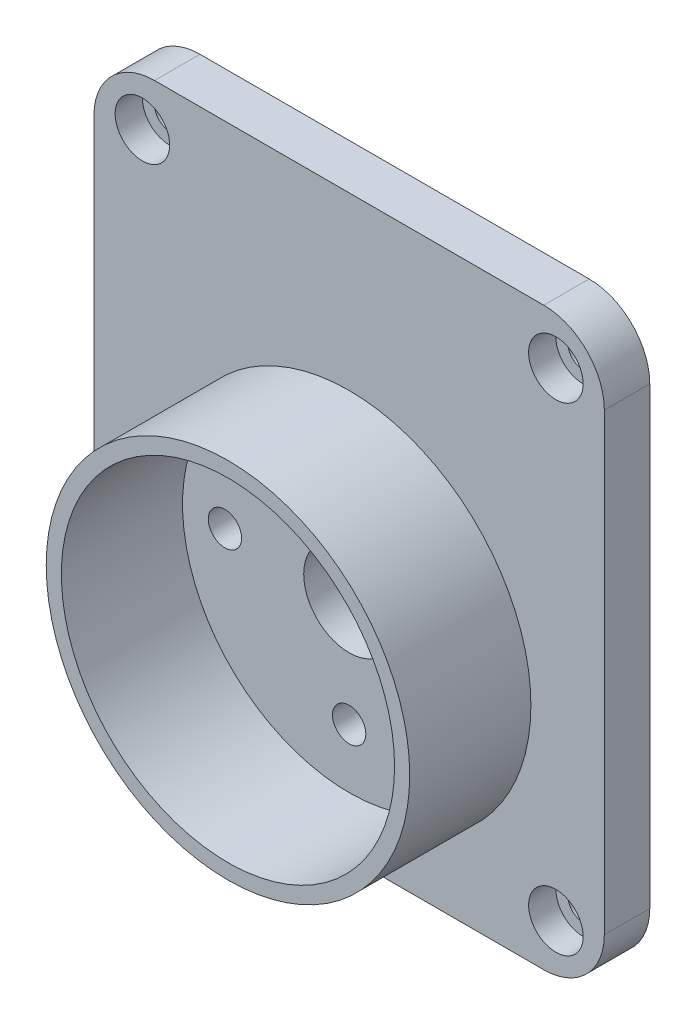
ISO-10303-21;
HEADER;
FILE_DESCRIPTION(('STEP AP214'),'2;1');
FILE_NAME('part.step','',(''),(''),'','','');
FILE_SCHEMA(('AUTOMOTIVE_DESIGN { 1 0 10303 214 1 1 1 1 }'));
ENDSEC;
DATA;
#1=APPLICATION_CONTEXT('core data for automotive mechanical design processes');
#2=APPLICATION_PROTOCOL_DEFINITION('international standard','automotive_design',2000,#1);
#3=PRODUCT_CONTEXT('',#1,'mechanical');
#4=PRODUCT('Part','Part','',(#3));
#5=PRODUCT_RELATED_PRODUCT_CATEGORY('part','',(#4));
#6=PRODUCT_DEFINITION_FORMATION('','',#4);
#7=PRODUCT_DEFINITION_CONTEXT('part definition',#1,'design');
#8=PRODUCT_DEFINITION('design','',#6,#7);
#9=PRODUCT_DEFINITION_SHAPE('','',#8);
#10=(LENGTH_UNIT() NAMED_UNIT(*) SI_UNIT(.MILLI.,.METRE.));
#11=(NAMED_UNIT(*) PLANE_ANGLE_UNIT() SI_UNIT($,.RADIAN.));
#12=(NAMED_UNIT(*) SI_UNIT($,.STERADIAN.) SOLID_ANGLE_UNIT());
#13=UNCERTAINTY_MEASURE_WITH_UNIT(LENGTH_MEASURE(1.E-05),#10,'distance_accuracy_value','');
#14=(GEOMETRIC_REPRESENTATION_CONTEXT(3) GLOBAL_UNCERTAINTY_ASSIGNED_CONTEXT((#13)) GLOBAL_UNIT_ASSIGNED_CONTEXT((#10,
#11,#12)) REPRESENTATION_CONTEXT('',''));
#15=CARTESIAN_POINT('',(0.,0.,0.));
#16=DIRECTION('',(0.,0.,1.));
#17=DIRECTION('',(1.,0.,0.));
#18=AXIS2_PLACEMENT_3D('',#15,#16,#17);
#19=CARTESIAN_POINT('',(-13.65,-11.5,3.));
#20=DIRECTION('',(0.,0.,-1.));
#21=DIRECTION('',(-1.,0.,0.));
#22=AXIS2_PLACEMENT_3D('',#19,#20,#21);
#23=CYLINDRICAL_SURFACE('',#22,1.);
#24=CARTESIAN_POINT('',(-13.65,-11.5,0.));
#25=DIRECTION('',(0.,0.,1.));
#26=DIRECTION('',(1.,0.,0.));
#27=AXIS2_PLACEMENT_3D('',#24,#25,#26);
#28=CIRCLE('',#27,1.);
#29=CARTESIAN_POINT('',(-12.65,-11.5,0.));
#30=VERTEX_POINT('',#29);
#31=EDGE_CURVE('E249',#30,#30,#28,.T.);
#32=ORIENTED_EDGE('',*,*,#31,.F.);
#33=EDGE_LOOP('',(#32));
#34=FACE_BOUND('',#33,.T.);
#35=CARTESIAN_POINT('',(-13.65,-11.5,1.2));
#36=DIRECTION('',(0.,0.,1.));
#37=DIRECTION('',(1.,0.,0.));
#38=AXIS2_PLACEMENT_3D('',#35,#36,#37);
#39=CIRCLE('',#38,1.);
#40=CARTESIAN_POINT('',(-12.65,-11.5,1.2));
#41=VERTEX_POINT('',#40);
#42=EDGE_CURVE('E315',#41,#41,#39,.T.);
#43=ORIENTED_EDGE('',*,*,#42,.T.);
#44=EDGE_LOOP('',(#43));
#45=FACE_BOUND('',#44,.T.);
#46=ADVANCED_FACE('F36',(#34,#45),#23,.F.);
#47=CARTESIAN_POINT('',(13.65,-11.5,3.));
#48=DIRECTION('',(0.,0.,-1.));
#49=DIRECTION('',(-1.,0.,0.));
#50=AXIS2_PLACEMENT_3D('',#47,#48,#49);
#51=CYLINDRICAL_SURFACE('',#50,0.999999999999999);
#52=CARTESIAN_POINT('',(13.65,-11.5,0.));
#53=DIRECTION('',(0.,0.,1.));
#54=DIRECTION('',(1.,0.,0.));
#55=AXIS2_PLACEMENT_3D('',#52,#53,#54);
#56=CIRCLE('',#55,0.999999999999999);
#57=CARTESIAN_POINT('',(14.65,-11.5,0.));
#58=VERTEX_POINT('',#57);
#59=EDGE_CURVE('E254',#58,#58,#56,.T.);
#60=ORIENTED_EDGE('',*,*,#59,.F.);
#61=EDGE_LOOP('',(#60));
#62=FACE_BOUND('',#61,.T.);
#63=CARTESIAN_POINT('',(13.65,-11.5,1.2));
#64=DIRECTION('',(0.,0.,1.));
#65=DIRECTION('',(1.,0.,0.));
#66=AXIS2_PLACEMENT_3D('',#63,#64,#65);
#67=CIRCLE('',#66,0.999999999999999);
#68=CARTESIAN_POINT('',(14.65,-11.5,1.2));
#69=VERTEX_POINT('',#68);
#70=EDGE_CURVE('E310',#69,#69,#67,.T.);
#71=ORIENTED_EDGE('',*,*,#70,.T.);
#72=EDGE_LOOP('',(#71));
#73=FACE_BOUND('',#72,.T.);
#74=ADVANCED_FACE('F392',(#62,#73),#51,.F.);
#75=CARTESIAN_POINT('',(13.65,20.1,3.));
#76=DIRECTION('',(0.,0.,-1.));
#77=DIRECTION('',(-1.,0.,0.));
#78=AXIS2_PLACEMENT_3D('',#75,#76,#77);
#79=CYLINDRICAL_SURFACE('',#78,1.);
#80=CARTESIAN_POINT('',(13.65,20.1,0.));
#81=DIRECTION('',(0.,0.,1.));
#82=DIRECTION('',(1.,0.,0.));
#83=AXIS2_PLACEMENT_3D('',#80,#81,#82);
#84=CIRCLE('',#83,1.);
#85=CARTESIAN_POINT('',(14.65,20.1,0.));
#86=VERTEX_POINT('',#85);
#87=EDGE_CURVE('E257',#86,#86,#84,.T.);
#88=ORIENTED_EDGE('',*,*,#87,.F.);
#89=EDGE_LOOP('',(#88));
#90=FACE_BOUND('',#89,.T.);
#91=CARTESIAN_POINT('',(13.65,20.1,1.2));
#92=DIRECTION('',(0.,0.,1.));
#93=DIRECTION('',(1.,0.,0.));
#94=AXIS2_PLACEMENT_3D('',#91,#92,#93);
#95=CIRCLE('',#94,1.);
#96=CARTESIAN_POINT('',(14.65,20.1,1.2));
#97=VERTEX_POINT('',#96);
#98=EDGE_CURVE('E306',#97,#97,#95,.T.);
#99=ORIENTED_EDGE('',*,*,#98,.T.);
#100=EDGE_LOOP('',(#99));
#101=FACE_BOUND('',#100,.T.);
#102=ADVANCED_FACE('F398',(#90,#101),#79,.F.);
#103=CARTESIAN_POINT('',(-13.65,20.1,3.));
#104=DIRECTION('',(0.,0.,-1.));
#105=DIRECTION('',(-1.,0.,0.));
#106=AXIS2_PLACEMENT_3D('',#103,#104,#105);
#107=CYLINDRICAL_SURFACE('',#106,1.);
#108=CARTESIAN_POINT('',(-13.65,20.1,0.));
#109=DIRECTION('',(0.,0.,1.));
#110=DIRECTION('',(1.,0.,0.));
#111=AXIS2_PLACEMENT_3D('',#108,#109,#110);
#112=CIRCLE('',#111,1.);
#113=CARTESIAN_POINT('',(-12.65,20.1,0.));
#114=VERTEX_POINT('',#113);
#115=EDGE_CURVE('E260',#114,#114,#112,.T.);
#116=ORIENTED_EDGE('',*,*,#115,.F.);
#117=EDGE_LOOP('',(#116));
#118=FACE_BOUND('',#117,.T.);
#119=CARTESIAN_POINT('',(-13.65,20.1,1.2));
#120=DIRECTION('',(0.,0.,1.));
#121=DIRECTION('',(1.,0.,0.));
#122=AXIS2_PLACEMENT_3D('',#119,#120,#121);
#123=CIRCLE('',#122,1.);
#124=CARTESIAN_POINT('',(-12.65,20.1,1.2));
#125=VERTEX_POINT('',#124);
#126=EDGE_CURVE('E213',#125,#125,#123,.T.);
#127=ORIENTED_EDGE('',*,*,#126,.T.);
#128=EDGE_LOOP('',(#127));
#129=FACE_BOUND('',#128,.T.);
#130=ADVANCED_FACE('F409',(#118,#129),#107,.F.);
#131=CARTESIAN_POINT('',(0.,0.,0.));
#132=DIRECTION('',(0.,0.,1.));
#133=DIRECTION('',(1.,0.,0.));
#134=AXIS2_PLACEMENT_3D('',#131,#132,#133);
#135=PLANE('',#134);
#136=ORIENTED_EDGE('',*,*,#31,.T.);
#137=EDGE_LOOP('',(#136));
#138=FACE_BOUND('',#137,.T.);
#139=ORIENTED_EDGE('',*,*,#59,.T.);
#140=EDGE_LOOP('',(#139));
#141=FACE_BOUND('',#140,.T.);
#142=ORIENTED_EDGE('',*,*,#87,.T.);
#143=EDGE_LOOP('',(#142));
#144=FACE_BOUND('',#143,.T.);
#145=ORIENTED_EDGE('',*,*,#115,.T.);
#146=EDGE_LOOP('',(#145));
#147=FACE_BOUND('',#146,.T.);
#148=DIRECTION('',(0.,-1.,0.));
#149=VECTOR('',#148,1.);
#150=CARTESIAN_POINT('',(-16.85,0.,0.));
#151=LINE('',#150,#149);
#152=CARTESIAN_POINT('',(-16.85,19.3,0.));
#153=VERTEX_POINT('',#152);
#154=CARTESIAN_POINT('',(-16.85,-10.7,0.));
#155=VERTEX_POINT('',#154);
#156=EDGE_CURVE('E278',#153,#155,#151,.T.);
#157=ORIENTED_EDGE('',*,*,#156,.F.);
#158=CARTESIAN_POINT('',(-12.85,19.3,0.));
#159=DIRECTION('',(0.,0.,1.));
#160=DIRECTION('',(1.,0.,0.));
#161=AXIS2_PLACEMENT_3D('',#158,#159,#160);
#162=CIRCLE('',#161,4.);
#163=CARTESIAN_POINT('',(-12.85,23.3,0.));
#164=VERTEX_POINT('',#163);
#165=EDGE_CURVE('E330',#153,#164,#162,.F.);
#166=ORIENTED_EDGE('',*,*,#165,.T.);
#167=DIRECTION('',(-1.,0.,0.));
#168=VECTOR('',#167,1.);
#169=CARTESIAN_POINT('',(16.85,23.3,0.));
#170=LINE('',#169,#168);
#171=CARTESIAN_POINT('',(12.85,23.3,0.));
#172=VERTEX_POINT('',#171);
#173=EDGE_CURVE('E283',#172,#164,#170,.T.);
#174=ORIENTED_EDGE('',*,*,#173,.F.);
#175=CARTESIAN_POINT('',(12.85,19.3,0.));
#176=DIRECTION('',(0.,0.,1.));
#177=DIRECTION('',(1.,0.,0.));
#178=AXIS2_PLACEMENT_3D('',#175,#176,#177);
#179=CIRCLE('',#178,4.);
#180=CARTESIAN_POINT('',(16.85,19.3,0.));
#181=VERTEX_POINT('',#180);
#182=EDGE_CURVE('E324',#172,#181,#179,.F.);
#183=ORIENTED_EDGE('',*,*,#182,.T.);
#184=DIRECTION('',(0.,1.,0.));
#185=VECTOR('',#184,1.);
#186=CARTESIAN_POINT('',(16.85,-14.7,0.));
#187=LINE('',#186,#185);
#188=CARTESIAN_POINT('',(16.85,-10.7,0.));
#189=VERTEX_POINT('',#188);
#190=EDGE_CURVE('E296',#189,#181,#187,.T.);
#191=ORIENTED_EDGE('',*,*,#190,.F.);
#192=CARTESIAN_POINT('',(12.85,-10.7,0.));
#193=DIRECTION('',(0.,0.,1.));
#194=DIRECTION('',(1.,0.,0.));
#195=AXIS2_PLACEMENT_3D('',#192,#193,#194);
#196=CIRCLE('',#195,4.);
#197=CARTESIAN_POINT('',(12.85,-14.7,0.));
#198=VERTEX_POINT('',#197);
#199=EDGE_CURVE('E326',#189,#198,#196,.F.);
#200=ORIENTED_EDGE('',*,*,#199,.T.);
#201=DIRECTION('',(1.,0.,0.));
#202=VECTOR('',#201,1.);
#203=CARTESIAN_POINT('',(0.,-14.7,0.));
#204=LINE('',#203,#202);
#205=CARTESIAN_POINT('',(-12.85,-14.7,0.));
#206=VERTEX_POINT('',#205);
#207=EDGE_CURVE('E293',#206,#198,#204,.T.);
#208=ORIENTED_EDGE('',*,*,#207,.F.);
#209=CARTESIAN_POINT('',(-12.85,-10.7,0.));
#210=DIRECTION('',(0.,0.,1.));
#211=DIRECTION('',(1.,0.,0.));
#212=AXIS2_PLACEMENT_3D('',#209,#210,#211);
#213=CIRCLE('',#212,4.);
#214=EDGE_CURVE('E328',#206,#155,#213,.F.);
#215=ORIENTED_EDGE('',*,*,#214,.T.);
#216=EDGE_LOOP('',(#157,#166,#174,#183,#191,#200,#208,#215));
#217=FACE_BOUND('',#216,.T.);
#218=CARTESIAN_POINT('',(-13.65,-11.5,0.));
#219=DIRECTION('',(0.,0.,-1.));
#220=DIRECTION('',(-1.,0.,0.));
#221=AXIS2_PLACEMENT_3D('',#218,#219,#220);
#222=CIRCLE('',#221,3.20000000000001);
#223=CARTESIAN_POINT('',(-15.85,-9.17620999227555,0.));
#224=VERTEX_POINT('',#223);
#225=CARTESIAN_POINT('',(-11.3262099922755,-13.7,0.));
#226=VERTEX_POINT('',#225);
#227=EDGE_CURVE('E168',#224,#226,#222,.T.);
#228=ORIENTED_EDGE('',*,*,#227,.T.);
#229=DIRECTION('',(-1.,0.,0.));
#230=VECTOR('',#229,1.);
#231=CARTESIAN_POINT('',(0.,-13.7,0.));
#232=LINE('',#231,#230);
#233=CARTESIAN_POINT('',(11.3262099922756,-13.7,0.));
#234=VERTEX_POINT('',#233);
#235=EDGE_CURVE('E177',#234,#226,#232,.T.);
#236=ORIENTED_EDGE('',*,*,#235,.F.);
#237=CARTESIAN_POINT('',(13.65,-11.5,0.));
#238=DIRECTION('',(0.,0.,-1.));
#239=DIRECTION('',(-1.,0.,0.));
#240=AXIS2_PLACEMENT_3D('',#237,#238,#239);
#241=CIRCLE('',#240,3.19999999999999);
#242=CARTESIAN_POINT('',(15.85,-9.17620999227554,0.));
#243=VERTEX_POINT('',#242);
#244=EDGE_CURVE('E180',#234,#243,#241,.T.);
#245=ORIENTED_EDGE('',*,*,#244,.T.);
#246=DIRECTION('',(0.,-1.,0.));
#247=VECTOR('',#246,1.);
#248=CARTESIAN_POINT('',(15.85,0.,0.));
#249=LINE('',#248,#247);
#250=CARTESIAN_POINT('',(15.85,17.7762099922755,0.));
#251=VERTEX_POINT('',#250);
#252=EDGE_CURVE('E224',#251,#243,#249,.T.);
#253=ORIENTED_EDGE('',*,*,#252,.F.);
#254=CARTESIAN_POINT('',(13.65,20.1,0.));
#255=DIRECTION('',(0.,0.,-1.));
#256=DIRECTION('',(-1.,0.,0.));
#257=AXIS2_PLACEMENT_3D('',#254,#255,#256);
#258=CIRCLE('',#257,3.2);
#259=CARTESIAN_POINT('',(11.3262099922756,22.3,0.));
#260=VERTEX_POINT('',#259);
#261=EDGE_CURVE('E221',#251,#260,#258,.T.);
#262=ORIENTED_EDGE('',*,*,#261,.T.);
#263=DIRECTION('',(-1.,0.,0.));
#264=VECTOR('',#263,1.);
#265=CARTESIAN_POINT('',(0.,22.3,0.));
#266=LINE('',#265,#264);
#267=CARTESIAN_POINT('',(-11.3262099922755,22.3,0.));
#268=VERTEX_POINT('',#267);
#269=EDGE_CURVE('E218',#260,#268,#266,.T.);
#270=ORIENTED_EDGE('',*,*,#269,.T.);
#271=CARTESIAN_POINT('',(-13.65,20.1,0.));
#272=DIRECTION('',(0.,0.,-1.));
#273=DIRECTION('',(-1.,0.,0.));
#274=AXIS2_PLACEMENT_3D('',#271,#272,#273);
#275=CIRCLE('',#274,3.20000000000001);
#276=CARTESIAN_POINT('',(-15.85,17.7762099922755,0.));
#277=VERTEX_POINT('',#276);
#278=EDGE_CURVE('E215',#268,#277,#275,.T.);
#279=ORIENTED_EDGE('',*,*,#278,.T.);
#280=DIRECTION('',(0.,-1.,0.));
#281=VECTOR('',#280,1.);
#282=CARTESIAN_POINT('',(-15.85,0.,0.));
#283=LINE('',#282,#281);
#284=EDGE_CURVE('E212',#277,#224,#283,.T.);
#285=ORIENTED_EDGE('',*,*,#284,.T.);
#286=EDGE_LOOP('',(#228,#236,#245,#253,#262,#270,#279,#285));
#287=FACE_BOUND('',#286,.T.);
#288=ADVANCED_FACE('F358',(#138,#141,#144,#147,#217,#287),#135,.F.);
#289=CARTESIAN_POINT('',(0.,0.,3.));
#290=DIRECTION('',(0.,0.,-1.));
#291=DIRECTION('',(-1.,0.,0.));
#292=AXIS2_PLACEMENT_3D('',#289,#290,#291);
#293=CYLINDRICAL_SURFACE('',#292,3.);
#294=CARTESIAN_POINT('',(0.,0.,3.));
#295=DIRECTION('',(0.,0.,1.));
#296=DIRECTION('',(1.,0.,0.));
#297=AXIS2_PLACEMENT_3D('',#294,#295,#296);
#298=CIRCLE('',#297,3.);
#299=CARTESIAN_POINT('',(3.,0.,3.));
#300=VERTEX_POINT('',#299);
#301=EDGE_CURVE('E275',#300,#300,#298,.T.);
#302=ORIENTED_EDGE('',*,*,#301,.T.);
#303=EDGE_LOOP('',(#302));
#304=FACE_BOUND('',#303,.T.);
#305=CARTESIAN_POINT('',(0.,0.,1.));
#306=DIRECTION('',(0.,0.,-1.));
#307=DIRECTION('',(-1.,0.,0.));
#308=AXIS2_PLACEMENT_3D('',#305,#306,#307);
#309=CIRCLE('',#308,3.);
#310=CARTESIAN_POINT('',(-3.,0.,1.));
#311=VERTEX_POINT('',#310);
#312=EDGE_CURVE('E197',#311,#311,#309,.F.);
#313=ORIENTED_EDGE('',*,*,#312,.F.);
#314=EDGE_LOOP('',(#313));
#315=FACE_BOUND('',#314,.T.);
#316=ADVANCED_FACE('F430',(#304,#315),#293,.F.);
#317=CARTESIAN_POINT('',(-8.2,0.,3.));
#318=DIRECTION('',(0.,0.,-1.));
#319=DIRECTION('',(-1.,0.,0.));
#320=AXIS2_PLACEMENT_3D('',#317,#318,#319);
#321=CYLINDRICAL_SURFACE('',#320,1.1);
#322=CARTESIAN_POINT('',(-8.2,0.,3.));
#323=DIRECTION('',(0.,0.,1.));
#324=DIRECTION('',(1.,0.,0.));
#325=AXIS2_PLACEMENT_3D('',#322,#323,#324);
#326=CIRCLE('',#325,1.1);
#327=CARTESIAN_POINT('',(-7.1,0.,3.));
#328=VERTEX_POINT('',#327);
#329=EDGE_CURVE('E272',#328,#328,#326,.T.);
#330=ORIENTED_EDGE('',*,*,#329,.T.);
#331=EDGE_LOOP('',(#330));
#332=FACE_BOUND('',#331,.T.);
#333=CARTESIAN_POINT('',(-8.2,0.,1.));
#334=DIRECTION('',(0.,0.,-1.));
#335=DIRECTION('',(-1.,0.,0.));
#336=AXIS2_PLACEMENT_3D('',#333,#334,#335);
#337=CIRCLE('',#336,1.1);
#338=CARTESIAN_POINT('',(-9.3,0.,1.));
#339=VERTEX_POINT('',#338);
#340=EDGE_CURVE('E169',#339,#339,#337,.F.);
#341=ORIENTED_EDGE('',*,*,#340,.F.);
#342=EDGE_LOOP('',(#341));
#343=FACE_BOUND('',#342,.T.);
#344=ADVANCED_FACE('F426',(#332,#343),#321,.F.);
#345=CARTESIAN_POINT('',(8.2,0.,3.));
#346=DIRECTION('',(0.,0.,-1.));
#347=DIRECTION('',(-1.,0.,0.));
#348=AXIS2_PLACEMENT_3D('',#345,#346,#347);
#349=CYLINDRICAL_SURFACE('',#348,1.1);
#350=CARTESIAN_POINT('',(8.2,0.,3.));
#351=DIRECTION('',(0.,0.,1.));
#352=DIRECTION('',(1.,0.,0.));
#353=AXIS2_PLACEMENT_3D('',#350,#351,#352);
#354=CIRCLE('',#353,1.1);
#355=CARTESIAN_POINT('',(9.3,0.,3.));
#356=VERTEX_POINT('',#355);
#357=EDGE_CURVE('E269',#356,#356,#354,.T.);
#358=ORIENTED_EDGE('',*,*,#357,.T.);
#359=EDGE_LOOP('',(#358));
#360=FACE_BOUND('',#359,.T.);
#361=CARTESIAN_POINT('',(8.2,0.,1.));
#362=DIRECTION('',(0.,0.,-1.));
#363=DIRECTION('',(-1.,0.,0.));
#364=AXIS2_PLACEMENT_3D('',#361,#362,#363);
#365=CIRCLE('',#364,1.1);
#366=CARTESIAN_POINT('',(7.1,0.,1.));
#367=VERTEX_POINT('',#366);
#368=EDGE_CURVE('E200',#367,#367,#365,.F.);
#369=ORIENTED_EDGE('',*,*,#368,.F.);
#370=EDGE_LOOP('',(#369));
#371=FACE_BOUND('',#370,.T.);
#372=ADVANCED_FACE('F422',(#360,#371),#349,.F.);
#373=CARTESIAN_POINT('',(0.,7.1,3.));
#374=DIRECTION('',(0.,0.,-1.));
#375=DIRECTION('',(-1.,0.,0.));
#376=AXIS2_PLACEMENT_3D('',#373,#374,#375);
#377=CYLINDRICAL_SURFACE('',#376,1.1);
#378=CARTESIAN_POINT('',(0.,7.1,3.));
#379=DIRECTION('',(0.,0.,1.));
#380=DIRECTION('',(1.,0.,0.));
#381=AXIS2_PLACEMENT_3D('',#378,#379,#380);
#382=CIRCLE('',#381,1.1);
#383=CARTESIAN_POINT('',(1.1,7.1,3.));
#384=VERTEX_POINT('',#383);
#385=EDGE_CURVE('E266',#384,#384,#382,.T.);
#386=ORIENTED_EDGE('',*,*,#385,.T.);
#387=EDGE_LOOP('',(#386));
#388=FACE_BOUND('',#387,.T.);
#389=CARTESIAN_POINT('',(0.,7.1,1.));
#390=DIRECTION('',(0.,0.,-1.));
#391=DIRECTION('',(-1.,0.,0.));
#392=AXIS2_PLACEMENT_3D('',#389,#390,#391);
#393=CIRCLE('',#392,1.1);
#394=CARTESIAN_POINT('',(-1.1,7.1,1.));
#395=VERTEX_POINT('',#394);
#396=EDGE_CURVE('E206',#395,#395,#393,.F.);
#397=ORIENTED_EDGE('',*,*,#396,.F.);
#398=EDGE_LOOP('',(#397));
#399=FACE_BOUND('',#398,.T.);
#400=ADVANCED_FACE('F418',(#388,#399),#377,.F.);
#401=CARTESIAN_POINT('',(0.,-7.1,3.));
#402=DIRECTION('',(0.,0.,-1.));
#403=DIRECTION('',(-1.,0.,0.));
#404=AXIS2_PLACEMENT_3D('',#401,#402,#403);
#405=CYLINDRICAL_SURFACE('',#404,1.1);
#406=CARTESIAN_POINT('',(0.,-7.1,3.));
#407=DIRECTION('',(0.,0.,1.));
#408=DIRECTION('',(1.,0.,0.));
#409=AXIS2_PLACEMENT_3D('',#406,#407,#408);
#410=CIRCLE('',#409,1.1);
#411=CARTESIAN_POINT('',(1.1,-7.1,3.));
#412=VERTEX_POINT('',#411);
#413=EDGE_CURVE('E263',#412,#412,#410,.T.);
#414=ORIENTED_EDGE('',*,*,#413,.T.);
#415=EDGE_LOOP('',(#414));
#416=FACE_BOUND('',#415,.T.);
#417=CARTESIAN_POINT('',(0.,-7.1,1.));
#418=DIRECTION('',(0.,0.,-1.));
#419=DIRECTION('',(-1.,0.,0.));
#420=AXIS2_PLACEMENT_3D('',#417,#418,#419);
#421=CIRCLE('',#420,1.1);
#422=CARTESIAN_POINT('',(-1.1,-7.1,1.));
#423=VERTEX_POINT('',#422);
#424=EDGE_CURVE('E203',#423,#423,#421,.F.);
#425=ORIENTED_EDGE('',*,*,#424,.F.);
#426=EDGE_LOOP('',(#425));
#427=FACE_BOUND('',#426,.T.);
#428=ADVANCED_FACE('F414',(#416,#427),#405,.F.);
#429=CARTESIAN_POINT('',(0.,0.,3.));
#430=DIRECTION('',(0.,0.,1.));
#431=DIRECTION('',(1.,0.,0.));
#432=AXIS2_PLACEMENT_3D('',#429,#430,#431);
#433=PLANE('',#432);
#434=ORIENTED_EDGE('',*,*,#413,.F.);
#435=EDGE_LOOP('',(#434));
#436=FACE_BOUND('',#435,.T.);
#437=ORIENTED_EDGE('',*,*,#357,.F.);
#438=EDGE_LOOP('',(#437));
#439=FACE_BOUND('',#438,.T.);
#440=ORIENTED_EDGE('',*,*,#301,.F.);
#441=EDGE_LOOP('',(#440));
#442=FACE_BOUND('',#441,.T.);
#443=ORIENTED_EDGE('',*,*,#329,.F.);
#444=EDGE_LOOP('',(#443));
#445=FACE_BOUND('',#444,.T.);
#446=ORIENTED_EDGE('',*,*,#385,.F.);
#447=EDGE_LOOP('',(#446));
#448=FACE_BOUND('',#447,.T.);
#449=CARTESIAN_POINT('',(0.,0.,3.));
#450=DIRECTION('',(0.,0.,1.));
#451=DIRECTION('',(1.,0.,0.));
#452=AXIS2_PLACEMENT_3D('',#449,#450,#451);
#453=CIRCLE('',#452,11.);
#454=CARTESIAN_POINT('',(11.,0.,3.));
#455=VERTEX_POINT('',#454);
#456=EDGE_CURVE('E290',#455,#455,#453,.F.);
#457=ORIENTED_EDGE('',*,*,#456,.F.);
#458=EDGE_LOOP('',(#457));
#459=FACE_BOUND('',#458,.T.);
#460=ADVANCED_FACE('F417',(#436,#439,#442,#445,#448,#459),#433,.T.);
#461=CARTESIAN_POINT('',(-13.65,-11.5,3.));
#462=DIRECTION('',(0.,0.,1.));
#463=DIRECTION('',(1.,0.,0.));
#464=AXIS2_PLACEMENT_3D('',#461,#462,#463);
#465=CIRCLE('',#464,1.8);
#466=CARTESIAN_POINT('',(-11.85,-11.5,3.));
#467=VERTEX_POINT('',#466);
#468=EDGE_CURVE('E793',#467,#467,#465,.T.);
#469=ORIENTED_EDGE('',*,*,#468,.F.);
#470=EDGE_LOOP('',(#469));
#471=FACE_BOUND('',#470,.T.);
#472=CARTESIAN_POINT('',(13.65,-11.5,3.));
#473=DIRECTION('',(0.,0.,1.));
#474=DIRECTION('',(1.,0.,0.));
#475=AXIS2_PLACEMENT_3D('',#472,#473,#474);
#476=CIRCLE('',#475,1.8);
#477=CARTESIAN_POINT('',(15.45,-11.5,3.));
#478=VERTEX_POINT('',#477);
#479=EDGE_CURVE('E318',#478,#478,#476,.T.);
#480=ORIENTED_EDGE('',*,*,#479,.F.);
#481=EDGE_LOOP('',(#480));
#482=FACE_BOUND('',#481,.T.);
#483=CARTESIAN_POINT('',(13.65,20.1,3.));
#484=DIRECTION('',(0.,0.,1.));
#485=DIRECTION('',(1.,0.,0.));
#486=AXIS2_PLACEMENT_3D('',#483,#484,#485);
#487=CIRCLE('',#486,1.8);
#488=CARTESIAN_POINT('',(15.45,20.1,3.));
#489=VERTEX_POINT('',#488);
#490=EDGE_CURVE('E313',#489,#489,#487,.T.);
#491=ORIENTED_EDGE('',*,*,#490,.F.);
#492=EDGE_LOOP('',(#491));
#493=FACE_BOUND('',#492,.T.);
#494=CARTESIAN_POINT('',(-13.65,20.1,3.));
#495=DIRECTION('',(0.,0.,1.));
#496=DIRECTION('',(1.,0.,0.));
#497=AXIS2_PLACEMENT_3D('',#494,#495,#496);
#498=CIRCLE('',#497,1.8);
#499=CARTESIAN_POINT('',(-11.85,20.1,3.));
#500=VERTEX_POINT('',#499);
#501=EDGE_CURVE('E183',#500,#500,#498,.T.);
#502=ORIENTED_EDGE('',*,*,#501,.F.);
#503=EDGE_LOOP('',(#502));
#504=FACE_BOUND('',#503,.T.);
#505=CARTESIAN_POINT('',(0.,0.,3.));
#506=DIRECTION('',(0.,0.,1.));
#507=DIRECTION('',(1.,0.,0.));
#508=AXIS2_PLACEMENT_3D('',#505,#506,#507);
#509=CIRCLE('',#508,12.);
#510=CARTESIAN_POINT('',(12.,0.,3.));
#511=VERTEX_POINT('',#510);
#512=EDGE_CURVE('E245',#511,#511,#509,.T.);
#513=ORIENTED_EDGE('',*,*,#512,.F.);
#514=EDGE_LOOP('',(#513));
#515=FACE_BOUND('',#514,.T.);
#516=DIRECTION('',(-1.,0.,0.));
#517=VECTOR('',#516,1.);
#518=CARTESIAN_POINT('',(16.85,23.3,3.));
#519=LINE('',#518,#517);
#520=CARTESIAN_POINT('',(12.85,23.3,3.));
#521=VERTEX_POINT('',#520);
#522=CARTESIAN_POINT('',(-12.85,23.3,3.));
#523=VERTEX_POINT('',#522);
#524=EDGE_CURVE('E287',#521,#523,#519,.T.);
#525=ORIENTED_EDGE('',*,*,#524,.T.);
#526=CARTESIAN_POINT('',(-12.85,19.3,3.));
#527=DIRECTION('',(0.,0.,1.));
#528=DIRECTION('',(1.,0.,0.));
#529=AXIS2_PLACEMENT_3D('',#526,#527,#528);
#530=CIRCLE('',#529,4.);
#531=CARTESIAN_POINT('',(-16.85,19.3,3.));
#532=VERTEX_POINT('',#531);
#533=EDGE_CURVE('E342',#523,#532,#530,.T.);
#534=ORIENTED_EDGE('',*,*,#533,.T.);
#535=DIRECTION('',(0.,-1.,0.));
#536=VECTOR('',#535,1.);
#537=CARTESIAN_POINT('',(-16.85,23.3,3.));
#538=LINE('',#537,#536);
#539=CARTESIAN_POINT('',(-16.85,-10.7,3.));
#540=VERTEX_POINT('',#539);
#541=EDGE_CURVE('E279',#532,#540,#538,.T.);
#542=ORIENTED_EDGE('',*,*,#541,.T.);
#543=CARTESIAN_POINT('',(-12.85,-10.7,3.));
#544=DIRECTION('',(0.,0.,1.));
#545=DIRECTION('',(1.,0.,0.));
#546=AXIS2_PLACEMENT_3D('',#543,#544,#545);
#547=CIRCLE('',#546,4.);
#548=CARTESIAN_POINT('',(-12.85,-14.7,3.));
#549=VERTEX_POINT('',#548);
#550=EDGE_CURVE('E340',#540,#549,#547,.T.);
#551=ORIENTED_EDGE('',*,*,#550,.T.);
#552=DIRECTION('',(1.,0.,0.));
#553=VECTOR('',#552,1.);
#554=CARTESIAN_POINT('',(-16.85,-14.7,3.));
#555=LINE('',#554,#553);
#556=CARTESIAN_POINT('',(12.85,-14.7,3.));
#557=VERTEX_POINT('',#556);
#558=EDGE_CURVE('E282',#549,#557,#555,.T.);
#559=ORIENTED_EDGE('',*,*,#558,.T.);
#560=CARTESIAN_POINT('',(12.85,-10.7,3.));
#561=DIRECTION('',(0.,0.,1.));
#562=DIRECTION('',(1.,0.,0.));
#563=AXIS2_PLACEMENT_3D('',#560,#561,#562);
#564=CIRCLE('',#563,4.);
#565=CARTESIAN_POINT('',(16.85,-10.7,3.));
#566=VERTEX_POINT('',#565);
#567=EDGE_CURVE('E57',#557,#566,#564,.T.);
#568=ORIENTED_EDGE('',*,*,#567,.T.);
#569=DIRECTION('',(0.,1.,0.));
#570=VECTOR('',#569,1.);
#571=CARTESIAN_POINT('',(16.85,-14.7,3.));
#572=LINE('',#571,#570);
#573=CARTESIAN_POINT('',(16.85,19.3,3.));
#574=VERTEX_POINT('',#573);
#575=EDGE_CURVE('E285',#566,#574,#572,.T.);
#576=ORIENTED_EDGE('',*,*,#575,.T.);
#577=CARTESIAN_POINT('',(12.85,19.3,3.));
#578=DIRECTION('',(0.,0.,1.));
#579=DIRECTION('',(1.,0.,0.));
#580=AXIS2_PLACEMENT_3D('',#577,#578,#579);
#581=CIRCLE('',#580,4.);
#582=EDGE_CURVE('E337',#574,#521,#581,.T.);
#583=ORIENTED_EDGE('',*,*,#582,.T.);
#584=EDGE_LOOP('',(#525,#534,#542,#551,#559,#568,#576,#583));
#585=FACE_BOUND('',#584,.T.);
#586=ADVANCED_FACE('F366',(#471,#482,#493,#504,#515,#585),#433,.T.);
#587=CARTESIAN_POINT('',(-16.85,0.,3.));
#588=DIRECTION('',(1.,0.,0.));
#589=DIRECTION('',(0.,1.,0.));
#590=AXIS2_PLACEMENT_3D('',#587,#588,#589);
#591=PLANE('',#590);
#592=ORIENTED_EDGE('',*,*,#541,.F.);
#593=DIRECTION('',(0.,0.,-1.));
#594=VECTOR('',#593,1.);
#595=CARTESIAN_POINT('',(-16.85,19.3,3.));
#596=LINE('',#595,#594);
#597=EDGE_CURVE('E321',#532,#153,#596,.T.);
#598=ORIENTED_EDGE('',*,*,#597,.T.);
#599=ORIENTED_EDGE('',*,*,#156,.T.);
#600=DIRECTION('',(0.,0.,-1.));
#601=VECTOR('',#600,1.);
#602=CARTESIAN_POINT('',(-16.85,-10.7,3.));
#603=LINE('',#602,#601);
#604=EDGE_CURVE('E302',#155,#540,#603,.F.);
#605=ORIENTED_EDGE('',*,*,#604,.T.);
#606=EDGE_LOOP('',(#592,#598,#599,#605));
#607=FACE_BOUND('',#606,.T.);
#608=ADVANCED_FACE('F380',(#607),#591,.F.);
#609=CARTESIAN_POINT('',(0.,-14.7,3.));
#610=DIRECTION('',(0.,1.,0.));
#611=DIRECTION('',(-1.,0.,0.));
#612=AXIS2_PLACEMENT_3D('',#609,#610,#611);
#613=PLANE('',#612);
#614=ORIENTED_EDGE('',*,*,#558,.F.);
#615=DIRECTION('',(0.,0.,-1.));
#616=VECTOR('',#615,1.);
#617=CARTESIAN_POINT('',(-12.85,-14.7,3.));
#618=LINE('',#617,#616);
#619=EDGE_CURVE('E346',#549,#206,#618,.T.);
#620=ORIENTED_EDGE('',*,*,#619,.T.);
#621=ORIENTED_EDGE('',*,*,#207,.T.);
#622=DIRECTION('',(0.,0.,-1.));
#623=VECTOR('',#622,1.);
#624=CARTESIAN_POINT('',(12.85,-14.7,3.));
#625=LINE('',#624,#623);
#626=EDGE_CURVE('E344',#198,#557,#625,.F.);
#627=ORIENTED_EDGE('',*,*,#626,.T.);
#628=EDGE_LOOP('',(#614,#620,#621,#627));
#629=FACE_BOUND('',#628,.T.);
#630=ADVANCED_FACE('F352',(#629),#613,.F.);
#631=CARTESIAN_POINT('',(16.85,-14.7,3.));
#632=DIRECTION('',(-1.,0.,0.));
#633=DIRECTION('',(0.,-1.,0.));
#634=AXIS2_PLACEMENT_3D('',#631,#632,#633);
#635=PLANE('',#634);
#636=ORIENTED_EDGE('',*,*,#575,.F.);
#637=DIRECTION('',(0.,0.,-1.));
#638=VECTOR('',#637,1.);
#639=CARTESIAN_POINT('',(16.85,-10.7,3.));
#640=LINE('',#639,#638);
#641=EDGE_CURVE('E11',#566,#189,#640,.T.);
#642=ORIENTED_EDGE('',*,*,#641,.T.);
#643=ORIENTED_EDGE('',*,*,#190,.T.);
#644=DIRECTION('',(0.,0.,-1.));
#645=VECTOR('',#644,1.);
#646=CARTESIAN_POINT('',(16.85,19.3,3.));
#647=LINE('',#646,#645);
#648=EDGE_CURVE('E44',#181,#574,#647,.F.);
#649=ORIENTED_EDGE('',*,*,#648,.T.);
#650=EDGE_LOOP('',(#636,#642,#643,#649));
#651=FACE_BOUND('',#650,.T.);
#652=ADVANCED_FACE('F364',(#651),#635,.F.);
#653=CARTESIAN_POINT('',(16.85,23.3,3.));
#654=DIRECTION('',(0.,-1.,0.));
#655=DIRECTION('',(1.,0.,0.));
#656=AXIS2_PLACEMENT_3D('',#653,#654,#655);
#657=PLANE('',#656);
#658=ORIENTED_EDGE('',*,*,#173,.T.);
#659=DIRECTION('',(0.,0.,-1.));
#660=VECTOR('',#659,1.);
#661=CARTESIAN_POINT('',(-12.85,23.3,3.));
#662=LINE('',#661,#660);
#663=EDGE_CURVE('E335',#164,#523,#662,.F.);
#664=ORIENTED_EDGE('',*,*,#663,.T.);
#665=ORIENTED_EDGE('',*,*,#524,.F.);
#666=DIRECTION('',(0.,0.,-1.));
#667=VECTOR('',#666,1.);
#668=CARTESIAN_POINT('',(12.85,23.3,3.));
#669=LINE('',#668,#667);
#670=EDGE_CURVE('E332',#521,#172,#669,.T.);
#671=ORIENTED_EDGE('',*,*,#670,.T.);
#672=EDGE_LOOP('',(#658,#664,#665,#671));
#673=FACE_BOUND('',#672,.T.);
#674=ADVANCED_FACE('F372',(#673),#657,.F.);
#675=CARTESIAN_POINT('',(0.,0.,11.));
#676=DIRECTION('',(0.,0.,1.));
#677=DIRECTION('',(1.,0.,0.));
#678=AXIS2_PLACEMENT_3D('',#675,#676,#677);
#679=PLANE('',#678);
#680=CARTESIAN_POINT('',(0.,0.,11.));
#681=DIRECTION('',(0.,0.,1.));
#682=DIRECTION('',(1.,0.,0.));
#683=AXIS2_PLACEMENT_3D('',#680,#681,#682);
#684=CIRCLE('',#683,12.);
#685=CARTESIAN_POINT('',(12.,0.,11.));
#686=VERTEX_POINT('',#685);
#687=EDGE_CURVE('E246',#686,#686,#684,.T.);
#688=ORIENTED_EDGE('',*,*,#687,.T.);
#689=EDGE_LOOP('',(#688));
#690=FACE_BOUND('',#689,.T.);
#691=CARTESIAN_POINT('',(0.,0.,11.));
#692=DIRECTION('',(0.,0.,1.));
#693=DIRECTION('',(1.,0.,0.));
#694=AXIS2_PLACEMENT_3D('',#691,#692,#693);
#695=CIRCLE('',#694,11.);
#696=CARTESIAN_POINT('',(11.,0.,11.));
#697=VERTEX_POINT('',#696);
#698=EDGE_CURVE('E231',#697,#697,#695,.T.);
#699=ORIENTED_EDGE('',*,*,#698,.F.);
#700=EDGE_LOOP('',(#699));
#701=FACE_BOUND('',#700,.T.);
#702=ADVANCED_FACE('F443',(#690,#701),#679,.T.);
#703=CARTESIAN_POINT('',(0.,0.,11.));
#704=DIRECTION('',(0.,0.,-1.));
#705=DIRECTION('',(-1.,0.,0.));
#706=AXIS2_PLACEMENT_3D('',#703,#704,#705);
#707=CYLINDRICAL_SURFACE('',#706,12.);
#708=ORIENTED_EDGE('',*,*,#687,.F.);
#709=EDGE_LOOP('',(#708));
#710=FACE_BOUND('',#709,.T.);
#711=ORIENTED_EDGE('',*,*,#512,.T.);
#712=EDGE_LOOP('',(#711));
#713=FACE_BOUND('',#712,.T.);
#714=ADVANCED_FACE('F404',(#710,#713),#707,.T.);
#715=CARTESIAN_POINT('',(0.,0.,11.));
#716=DIRECTION('',(0.,0.,-1.));
#717=DIRECTION('',(-1.,0.,0.));
#718=AXIS2_PLACEMENT_3D('',#715,#716,#717);
#719=CYLINDRICAL_SURFACE('',#718,11.);
#720=ORIENTED_EDGE('',*,*,#698,.T.);
#721=EDGE_LOOP('',(#720));
#722=FACE_BOUND('',#721,.T.);
#723=ORIENTED_EDGE('',*,*,#456,.T.);
#724=EDGE_LOOP('',(#723));
#725=FACE_BOUND('',#724,.T.);
#726=ADVANCED_FACE('F480',(#722,#725),#719,.F.);
#727=CARTESIAN_POINT('',(-13.65,-11.5,1.));
#728=DIRECTION('',(0.,0.,-1.));
#729=DIRECTION('',(-1.,0.,0.));
#730=AXIS2_PLACEMENT_3D('',#727,#728,#729);
#731=CYLINDRICAL_SURFACE('',#730,3.20000000000001);
#732=ORIENTED_EDGE('',*,*,#227,.F.);
#733=DIRECTION('',(0.,0.,-1.));
#734=VECTOR('',#733,1.);
#735=CARTESIAN_POINT('',(-15.85,-9.17620999227555,1.));
#736=LINE('',#735,#734);
#737=CARTESIAN_POINT('',(-15.85,-9.17620999227555,1.));
#738=VERTEX_POINT('',#737);
#739=EDGE_CURVE('E155',#738,#224,#736,.T.);
#740=ORIENTED_EDGE('',*,*,#739,.F.);
#741=CARTESIAN_POINT('',(-13.65,-11.5,1.));
#742=DIRECTION('',(0.,0.,-1.));
#743=DIRECTION('',(-1.,0.,0.));
#744=AXIS2_PLACEMENT_3D('',#741,#742,#743);
#745=CIRCLE('',#744,3.20000000000001);
#746=CARTESIAN_POINT('',(-11.3262099922755,-13.7,1.));
#747=VERTEX_POINT('',#746);
#748=EDGE_CURVE('E162',#738,#747,#745,.T.);
#749=ORIENTED_EDGE('',*,*,#748,.T.);
#750=DIRECTION('',(0.,0.,-1.));
#751=VECTOR('',#750,1.);
#752=CARTESIAN_POINT('',(-11.3262099922755,-13.7,1.));
#753=LINE('',#752,#751);
#754=EDGE_CURVE('E229',#747,#226,#753,.T.);
#755=ORIENTED_EDGE('',*,*,#754,.T.);
#756=EDGE_LOOP('',(#732,#740,#749,#755));
#757=FACE_BOUND('',#756,.T.);
#758=ADVANCED_FACE('F165',(#757),#731,.T.);
#759=CARTESIAN_POINT('',(0.,-13.7,1.));
#760=DIRECTION('',(0.,-1.,0.));
#761=DIRECTION('',(0.,0.,-1.));
#762=AXIS2_PLACEMENT_3D('',#759,#760,#761);
#763=PLANE('',#762);
#764=ORIENTED_EDGE('',*,*,#235,.T.);
#765=ORIENTED_EDGE('',*,*,#754,.F.);
#766=DIRECTION('',(-1.,0.,0.));
#767=VECTOR('',#766,1.);
#768=CARTESIAN_POINT('',(0.,-13.7,1.));
#769=LINE('',#768,#767);
#770=CARTESIAN_POINT('',(11.3262099922756,-13.7,1.));
#771=VERTEX_POINT('',#770);
#772=EDGE_CURVE('E176',#771,#747,#769,.T.);
#773=ORIENTED_EDGE('',*,*,#772,.F.);
#774=DIRECTION('',(0.,0.,-1.));
#775=VECTOR('',#774,1.);
#776=CARTESIAN_POINT('',(11.3262099922756,-13.7,1.));
#777=LINE('',#776,#775);
#778=EDGE_CURVE('E232',#771,#234,#777,.T.);
#779=ORIENTED_EDGE('',*,*,#778,.T.);
#780=EDGE_LOOP('',(#764,#765,#773,#779));
#781=FACE_BOUND('',#780,.T.);
#782=ADVANCED_FACE('F495',(#781),#763,.F.);
#783=CARTESIAN_POINT('',(13.65,-11.5,1.));
#784=DIRECTION('',(0.,0.,-1.));
#785=DIRECTION('',(-1.,0.,0.));
#786=AXIS2_PLACEMENT_3D('',#783,#784,#785);
#787=CYLINDRICAL_SURFACE('',#786,3.19999999999999);
#788=ORIENTED_EDGE('',*,*,#244,.F.);
#789=ORIENTED_EDGE('',*,*,#778,.F.);
#790=CARTESIAN_POINT('',(13.65,-11.5,1.));
#791=DIRECTION('',(0.,0.,-1.));
#792=DIRECTION('',(-1.,0.,0.));
#793=AXIS2_PLACEMENT_3D('',#790,#791,#792);
#794=CIRCLE('',#793,3.19999999999999);
#795=CARTESIAN_POINT('',(15.85,-9.17620999227554,1.));
#796=VERTEX_POINT('',#795);
#797=EDGE_CURVE('E194',#771,#796,#794,.T.);
#798=ORIENTED_EDGE('',*,*,#797,.T.);
#799=DIRECTION('',(0.,0.,-1.));
#800=VECTOR('',#799,1.);
#801=CARTESIAN_POINT('',(15.85,-9.17620999227554,1.));
#802=LINE('',#801,#800);
#803=EDGE_CURVE('E234',#796,#243,#802,.T.);
#804=ORIENTED_EDGE('',*,*,#803,.T.);
#805=EDGE_LOOP('',(#788,#789,#798,#804));
#806=FACE_BOUND('',#805,.T.);
#807=ADVANCED_FACE('F503',(#806),#787,.T.);
#808=CARTESIAN_POINT('',(15.85,0.,1.));
#809=DIRECTION('',(1.,0.,0.));
#810=DIRECTION('',(0.,1.,0.));
#811=AXIS2_PLACEMENT_3D('',#808,#809,#810);
#812=PLANE('',#811);
#813=ORIENTED_EDGE('',*,*,#252,.T.);
#814=ORIENTED_EDGE('',*,*,#803,.F.);
#815=DIRECTION('',(0.,-1.,0.));
#816=VECTOR('',#815,1.);
#817=CARTESIAN_POINT('',(15.85,0.,1.));
#818=LINE('',#817,#816);
#819=CARTESIAN_POINT('',(15.85,17.7762099922755,1.));
#820=VERTEX_POINT('',#819);
#821=EDGE_CURVE('E191',#820,#796,#818,.T.);
#822=ORIENTED_EDGE('',*,*,#821,.F.);
#823=DIRECTION('',(0.,0.,-1.));
#824=VECTOR('',#823,1.);
#825=CARTESIAN_POINT('',(15.85,17.7762099922755,1.));
#826=LINE('',#825,#824);
#827=EDGE_CURVE('E236',#820,#251,#826,.T.);
#828=ORIENTED_EDGE('',*,*,#827,.T.);
#829=EDGE_LOOP('',(#813,#814,#822,#828));
#830=FACE_BOUND('',#829,.T.);
#831=ADVANCED_FACE('F511',(#830),#812,.F.);
#832=CARTESIAN_POINT('',(13.65,20.1,1.));
#833=DIRECTION('',(0.,0.,-1.));
#834=DIRECTION('',(-1.,0.,0.));
#835=AXIS2_PLACEMENT_3D('',#832,#833,#834);
#836=CYLINDRICAL_SURFACE('',#835,3.2);
#837=ORIENTED_EDGE('',*,*,#261,.F.);
#838=ORIENTED_EDGE('',*,*,#827,.F.);
#839=CARTESIAN_POINT('',(13.65,20.1,1.));
#840=DIRECTION('',(0.,0.,-1.));
#841=DIRECTION('',(-1.,0.,0.));
#842=AXIS2_PLACEMENT_3D('',#839,#840,#841);
#843=CIRCLE('',#842,3.2);
#844=CARTESIAN_POINT('',(11.3262099922756,22.3,1.));
#845=VERTEX_POINT('',#844);
#846=EDGE_CURVE('E189',#820,#845,#843,.T.);
#847=ORIENTED_EDGE('',*,*,#846,.T.);
#848=DIRECTION('',(0.,0.,-1.));
#849=VECTOR('',#848,1.);
#850=CARTESIAN_POINT('',(11.3262099922756,22.3,1.));
#851=LINE('',#850,#849);
#852=EDGE_CURVE('E238',#845,#260,#851,.T.);
#853=ORIENTED_EDGE('',*,*,#852,.T.);
#854=EDGE_LOOP('',(#837,#838,#847,#853));
#855=FACE_BOUND('',#854,.T.);
#856=ADVANCED_FACE('F519',(#855),#836,.T.);
#857=CARTESIAN_POINT('',(0.,22.3,1.));
#858=DIRECTION('',(0.,-1.,0.));
#859=DIRECTION('',(0.,0.,-1.));
#860=AXIS2_PLACEMENT_3D('',#857,#858,#859);
#861=PLANE('',#860);
#862=ORIENTED_EDGE('',*,*,#269,.F.);
#863=ORIENTED_EDGE('',*,*,#852,.F.);
#864=DIRECTION('',(-1.,0.,0.));
#865=VECTOR('',#864,1.);
#866=CARTESIAN_POINT('',(0.,22.3,1.));
#867=LINE('',#866,#865);
#868=CARTESIAN_POINT('',(-11.3262099922755,22.3,1.));
#869=VERTEX_POINT('',#868);
#870=EDGE_CURVE('E187',#845,#869,#867,.T.);
#871=ORIENTED_EDGE('',*,*,#870,.T.);
#872=DIRECTION('',(0.,0.,-1.));
#873=VECTOR('',#872,1.);
#874=CARTESIAN_POINT('',(-11.3262099922755,22.3,1.));
#875=LINE('',#874,#873);
#876=EDGE_CURVE('E240',#869,#268,#875,.T.);
#877=ORIENTED_EDGE('',*,*,#876,.T.);
#878=EDGE_LOOP('',(#862,#863,#871,#877));
#879=FACE_BOUND('',#878,.T.);
#880=ADVANCED_FACE('F527',(#879),#861,.T.);
#881=CARTESIAN_POINT('',(-13.65,20.1,1.));
#882=DIRECTION('',(0.,0.,-1.));
#883=DIRECTION('',(-1.,0.,0.));
#884=AXIS2_PLACEMENT_3D('',#881,#882,#883);
#885=CYLINDRICAL_SURFACE('',#884,3.20000000000001);
#886=ORIENTED_EDGE('',*,*,#278,.F.);
#887=ORIENTED_EDGE('',*,*,#876,.F.);
#888=CARTESIAN_POINT('',(-13.65,20.1,1.));
#889=DIRECTION('',(0.,0.,-1.));
#890=DIRECTION('',(-1.,0.,0.));
#891=AXIS2_PLACEMENT_3D('',#888,#889,#890);
#892=CIRCLE('',#891,3.20000000000001);
#893=CARTESIAN_POINT('',(-15.85,17.7762099922755,1.));
#894=VERTEX_POINT('',#893);
#895=EDGE_CURVE('E161',#869,#894,#892,.T.);
#896=ORIENTED_EDGE('',*,*,#895,.T.);
#897=DIRECTION('',(0.,0.,-1.));
#898=VECTOR('',#897,1.);
#899=CARTESIAN_POINT('',(-15.85,17.7762099922755,1.));
#900=LINE('',#899,#898);
#901=EDGE_CURVE('E157',#894,#277,#900,.T.);
#902=ORIENTED_EDGE('',*,*,#901,.T.);
#903=EDGE_LOOP('',(#886,#887,#896,#902));
#904=FACE_BOUND('',#903,.T.);
#905=ADVANCED_FACE('F535',(#904),#885,.T.);
#906=CARTESIAN_POINT('',(-15.85,0.,1.));
#907=DIRECTION('',(1.,0.,0.));
#908=DIRECTION('',(0.,1.,0.));
#909=AXIS2_PLACEMENT_3D('',#906,#907,#908);
#910=PLANE('',#909);
#911=ORIENTED_EDGE('',*,*,#284,.F.);
#912=ORIENTED_EDGE('',*,*,#901,.F.);
#913=DIRECTION('',(0.,-1.,0.));
#914=VECTOR('',#913,1.);
#915=CARTESIAN_POINT('',(-15.85,0.,1.));
#916=LINE('',#915,#914);
#917=EDGE_CURVE('E151',#894,#738,#916,.T.);
#918=ORIENTED_EDGE('',*,*,#917,.T.);
#919=ORIENTED_EDGE('',*,*,#739,.T.);
#920=EDGE_LOOP('',(#911,#912,#918,#919));
#921=FACE_BOUND('',#920,.T.);
#922=ADVANCED_FACE('F154',(#921),#910,.T.);
#923=CARTESIAN_POINT('',(0.,0.,1.));
#924=DIRECTION('',(0.,0.,-1.));
#925=DIRECTION('',(-1.,0.,0.));
#926=AXIS2_PLACEMENT_3D('',#923,#924,#925);
#927=PLANE('',#926);
#928=ORIENTED_EDGE('',*,*,#748,.F.);
#929=ORIENTED_EDGE('',*,*,#917,.F.);
#930=ORIENTED_EDGE('',*,*,#895,.F.);
#931=ORIENTED_EDGE('',*,*,#870,.F.);
#932=ORIENTED_EDGE('',*,*,#846,.F.);
#933=ORIENTED_EDGE('',*,*,#821,.T.);
#934=ORIENTED_EDGE('',*,*,#797,.F.);
#935=ORIENTED_EDGE('',*,*,#772,.T.);
#936=EDGE_LOOP('',(#928,#929,#930,#931,#932,#933,#934,#935));
#937=FACE_BOUND('',#936,.T.);
#938=ORIENTED_EDGE('',*,*,#312,.T.);
#939=EDGE_LOOP('',(#938));
#940=FACE_BOUND('',#939,.T.);
#941=ORIENTED_EDGE('',*,*,#368,.T.);
#942=EDGE_LOOP('',(#941));
#943=FACE_BOUND('',#942,.T.);
#944=ORIENTED_EDGE('',*,*,#424,.T.);
#945=EDGE_LOOP('',(#944));
#946=FACE_BOUND('',#945,.T.);
#947=ORIENTED_EDGE('',*,*,#396,.T.);
#948=EDGE_LOOP('',(#947));
#949=FACE_BOUND('',#948,.T.);
#950=ORIENTED_EDGE('',*,*,#340,.T.);
#951=EDGE_LOOP('',(#950));
#952=FACE_BOUND('',#951,.T.);
#953=ADVANCED_FACE('F172',(#937,#940,#943,#946,#949,#952),#927,.T.);
#954=CARTESIAN_POINT('',(-13.65,20.1,1.2));
#955=DIRECTION('',(0.,0.,1.));
#956=DIRECTION('',(1.,0.,0.));
#957=AXIS2_PLACEMENT_3D('',#954,#955,#956);
#958=CYLINDRICAL_SURFACE('',#957,1.8);
#959=CARTESIAN_POINT('',(-13.65,20.1,1.2));
#960=DIRECTION('',(0.,0.,1.));
#961=DIRECTION('',(1.,0.,0.));
#962=AXIS2_PLACEMENT_3D('',#959,#960,#961);
#963=CIRCLE('',#962,1.8);
#964=CARTESIAN_POINT('',(-11.85,20.1,1.2));
#965=VERTEX_POINT('',#964);
#966=EDGE_CURVE('E305',#965,#965,#963,.T.);
#967=ORIENTED_EDGE('',*,*,#966,.F.);
#968=EDGE_LOOP('',(#967));
#969=FACE_BOUND('',#968,.T.);
#970=ORIENTED_EDGE('',*,*,#501,.T.);
#971=EDGE_LOOP('',(#970));
#972=FACE_BOUND('',#971,.T.);
#973=ADVANCED_FACE('F556',(#969,#972),#958,.F.);
#974=CARTESIAN_POINT('',(-13.65,20.1,1.2));
#975=DIRECTION('',(0.,0.,1.));
#976=DIRECTION('',(1.,0.,0.));
#977=AXIS2_PLACEMENT_3D('',#974,#975,#976);
#978=PLANE('',#977);
#979=ORIENTED_EDGE('',*,*,#126,.F.);
#980=EDGE_LOOP('',(#979));
#981=FACE_BOUND('',#980,.T.);
#982=ORIENTED_EDGE('',*,*,#966,.T.);
#983=EDGE_LOOP('',(#982));
#984=FACE_BOUND('',#983,.T.);
#985=ADVANCED_FACE('F563',(#981,#984),#978,.T.);
#986=CARTESIAN_POINT('',(13.65,20.1,1.2));
#987=DIRECTION('',(0.,0.,1.));
#988=DIRECTION('',(1.,0.,0.));
#989=AXIS2_PLACEMENT_3D('',#986,#987,#988);
#990=CYLINDRICAL_SURFACE('',#989,1.8);
#991=CARTESIAN_POINT('',(13.65,20.1,1.2));
#992=DIRECTION('',(0.,0.,1.));
#993=DIRECTION('',(1.,0.,0.));
#994=AXIS2_PLACEMENT_3D('',#991,#992,#993);
#995=CIRCLE('',#994,1.8);
#996=CARTESIAN_POINT('',(15.45,20.1,1.2));
#997=VERTEX_POINT('',#996);
#998=EDGE_CURVE('E309',#997,#997,#995,.T.);
#999=ORIENTED_EDGE('',*,*,#998,.F.);
#1000=EDGE_LOOP('',(#999));
#1001=FACE_BOUND('',#1000,.T.);
#1002=ORIENTED_EDGE('',*,*,#490,.T.);
#1003=EDGE_LOOP('',(#1002));
#1004=FACE_BOUND('',#1003,.T.);
#1005=ADVANCED_FACE('F572',(#1001,#1004),#990,.F.);
#1006=CARTESIAN_POINT('',(13.65,20.1,1.2));
#1007=DIRECTION('',(0.,0.,1.));
#1008=DIRECTION('',(1.,0.,0.));
#1009=AXIS2_PLACEMENT_3D('',#1006,#1007,#1008);
#1010=PLANE('',#1009);
#1011=ORIENTED_EDGE('',*,*,#98,.F.);
#1012=EDGE_LOOP('',(#1011));
#1013=FACE_BOUND('',#1012,.T.);
#1014=ORIENTED_EDGE('',*,*,#998,.T.);
#1015=EDGE_LOOP('',(#1014));
#1016=FACE_BOUND('',#1015,.T.);
#1017=ADVANCED_FACE('F580',(#1013,#1016),#1010,.T.);
#1018=CARTESIAN_POINT('',(13.65,-11.5,1.2));
#1019=DIRECTION('',(0.,0.,1.));
#1020=DIRECTION('',(1.,0.,0.));
#1021=AXIS2_PLACEMENT_3D('',#1018,#1019,#1020);
#1022=CYLINDRICAL_SURFACE('',#1021,1.8);
#1023=CARTESIAN_POINT('',(13.65,-11.5,1.2));
#1024=DIRECTION('',(0.,0.,1.));
#1025=DIRECTION('',(1.,0.,0.));
#1026=AXIS2_PLACEMENT_3D('',#1023,#1024,#1025);
#1027=CIRCLE('',#1026,1.8);
#1028=CARTESIAN_POINT('',(15.45,-11.5,1.2));
#1029=VERTEX_POINT('',#1028);
#1030=EDGE_CURVE('E314',#1029,#1029,#1027,.T.);
#1031=ORIENTED_EDGE('',*,*,#1030,.F.);
#1032=EDGE_LOOP('',(#1031));
#1033=FACE_BOUND('',#1032,.T.);
#1034=ORIENTED_EDGE('',*,*,#479,.T.);
#1035=EDGE_LOOP('',(#1034));
#1036=FACE_BOUND('',#1035,.T.);
#1037=ADVANCED_FACE('F588',(#1033,#1036),#1022,.F.);
#1038=CARTESIAN_POINT('',(13.65,-11.5,1.2));
#1039=DIRECTION('',(0.,0.,1.));
#1040=DIRECTION('',(1.,0.,0.));
#1041=AXIS2_PLACEMENT_3D('',#1038,#1039,#1040);
#1042=PLANE('',#1041);
#1043=ORIENTED_EDGE('',*,*,#70,.F.);
#1044=EDGE_LOOP('',(#1043));
#1045=FACE_BOUND('',#1044,.T.);
#1046=ORIENTED_EDGE('',*,*,#1030,.T.);
#1047=EDGE_LOOP('',(#1046));
#1048=FACE_BOUND('',#1047,.T.);
#1049=ADVANCED_FACE('F596',(#1045,#1048),#1042,.T.);
#1050=CARTESIAN_POINT('',(-13.65,-11.5,1.2));
#1051=DIRECTION('',(0.,0.,1.));
#1052=DIRECTION('',(1.,0.,0.));
#1053=AXIS2_PLACEMENT_3D('',#1050,#1051,#1052);
#1054=CYLINDRICAL_SURFACE('',#1053,1.8);
#1055=CARTESIAN_POINT('',(-13.65,-11.5,1.2));
#1056=DIRECTION('',(0.,0.,1.));
#1057=DIRECTION('',(1.,0.,0.));
#1058=AXIS2_PLACEMENT_3D('',#1055,#1056,#1057);
#1059=CIRCLE('',#1058,1.8);
#1060=CARTESIAN_POINT('',(-11.85,-11.5,1.2));
#1061=VERTEX_POINT('',#1060);
#1062=EDGE_CURVE('E319',#1061,#1061,#1059,.T.);
#1063=ORIENTED_EDGE('',*,*,#1062,.F.);
#1064=EDGE_LOOP('',(#1063));
#1065=FACE_BOUND('',#1064,.T.);
#1066=ORIENTED_EDGE('',*,*,#468,.T.);
#1067=EDGE_LOOP('',(#1066));
#1068=FACE_BOUND('',#1067,.T.);
#1069=ADVANCED_FACE('F604',(#1065,#1068),#1054,.F.);
#1070=CARTESIAN_POINT('',(-13.65,-11.5,1.2));
#1071=DIRECTION('',(0.,0.,1.));
#1072=DIRECTION('',(1.,0.,0.));
#1073=AXIS2_PLACEMENT_3D('',#1070,#1071,#1072);
#1074=PLANE('',#1073);
#1075=ORIENTED_EDGE('',*,*,#42,.F.);
#1076=EDGE_LOOP('',(#1075));
#1077=FACE_BOUND('',#1076,.T.);
#1078=ORIENTED_EDGE('',*,*,#1062,.T.);
#1079=EDGE_LOOP('',(#1078));
#1080=FACE_BOUND('',#1079,.T.);
#1081=ADVANCED_FACE('F389',(#1077,#1080),#1074,.T.);
#1082=CARTESIAN_POINT('',(-12.85,19.3,3.));
#1083=DIRECTION('',(0.,0.,-1.));
#1084=DIRECTION('',(-1.,0.,0.));
#1085=AXIS2_PLACEMENT_3D('',#1082,#1083,#1084);
#1086=CYLINDRICAL_SURFACE('',#1085,4.);
#1087=ORIENTED_EDGE('',*,*,#533,.F.);
#1088=ORIENTED_EDGE('',*,*,#663,.F.);
#1089=ORIENTED_EDGE('',*,*,#165,.F.);
#1090=ORIENTED_EDGE('',*,*,#597,.F.);
#1091=EDGE_LOOP('',(#1087,#1088,#1089,#1090));
#1092=FACE_BOUND('',#1091,.T.);
#1093=ADVANCED_FACE('F377',(#1092),#1086,.T.);
#1094=CARTESIAN_POINT('',(-12.85,-10.7,3.));
#1095=DIRECTION('',(0.,0.,-1.));
#1096=DIRECTION('',(-1.,0.,0.));
#1097=AXIS2_PLACEMENT_3D('',#1094,#1095,#1096);
#1098=CYLINDRICAL_SURFACE('',#1097,4.);
#1099=ORIENTED_EDGE('',*,*,#550,.F.);
#1100=ORIENTED_EDGE('',*,*,#604,.F.);
#1101=ORIENTED_EDGE('',*,*,#214,.F.);
#1102=ORIENTED_EDGE('',*,*,#619,.F.);
#1103=EDGE_LOOP('',(#1099,#1100,#1101,#1102));
#1104=FACE_BOUND('',#1103,.T.);
#1105=ADVANCED_FACE('F382',(#1104),#1098,.T.);
#1106=CARTESIAN_POINT('',(12.85,-10.7,3.));
#1107=DIRECTION('',(0.,0.,-1.));
#1108=DIRECTION('',(-1.,0.,0.));
#1109=AXIS2_PLACEMENT_3D('',#1106,#1107,#1108);
#1110=CYLINDRICAL_SURFACE('',#1109,4.);
#1111=ORIENTED_EDGE('',*,*,#567,.F.);
#1112=ORIENTED_EDGE('',*,*,#626,.F.);
#1113=ORIENTED_EDGE('',*,*,#199,.F.);
#1114=ORIENTED_EDGE('',*,*,#641,.F.);
#1115=EDGE_LOOP('',(#1111,#1112,#1113,#1114));
#1116=FACE_BOUND('',#1115,.T.);
#1117=ADVANCED_FACE('F363',(#1116),#1110,.T.);
#1118=CARTESIAN_POINT('',(12.85,19.3,3.));
#1119=DIRECTION('',(0.,0.,-1.));
#1120=DIRECTION('',(-1.,0.,0.));
#1121=AXIS2_PLACEMENT_3D('',#1118,#1119,#1120);
#1122=CYLINDRICAL_SURFACE('',#1121,4.);
#1123=ORIENTED_EDGE('',*,*,#582,.F.);
#1124=ORIENTED_EDGE('',*,*,#648,.F.);
#1125=ORIENTED_EDGE('',*,*,#182,.F.);
#1126=ORIENTED_EDGE('',*,*,#670,.F.);
#1127=EDGE_LOOP('',(#1123,#1124,#1125,#1126));
#1128=FACE_BOUND('',#1127,.T.);
#1129=ADVANCED_FACE('F38',(#1128),#1122,.T.);
#1130=CLOSED_SHELL('',(#46,#74,#102,#130,#288,#316,#344,#372,#400,#428,#460,#586,#608,#630,#652,
#674,#702,#714,#726,#758,#782,#807,#831,#856,#880,#905,#922,#953,#973,#985,#1005,#1017,#1037,
#1049,#1069,#1081,#1093,#1105,#1117,#1129));
#1131=MANIFOLD_SOLID_BREP('B2',#1130);
#1132=ADVANCED_BREP_SHAPE_REPRESENTATION('',(#18,#1131),#14);
#1133=SHAPE_DEFINITION_REPRESENTATION(#9,#1132);
ENDSEC;
END-ISO-10303-21;
